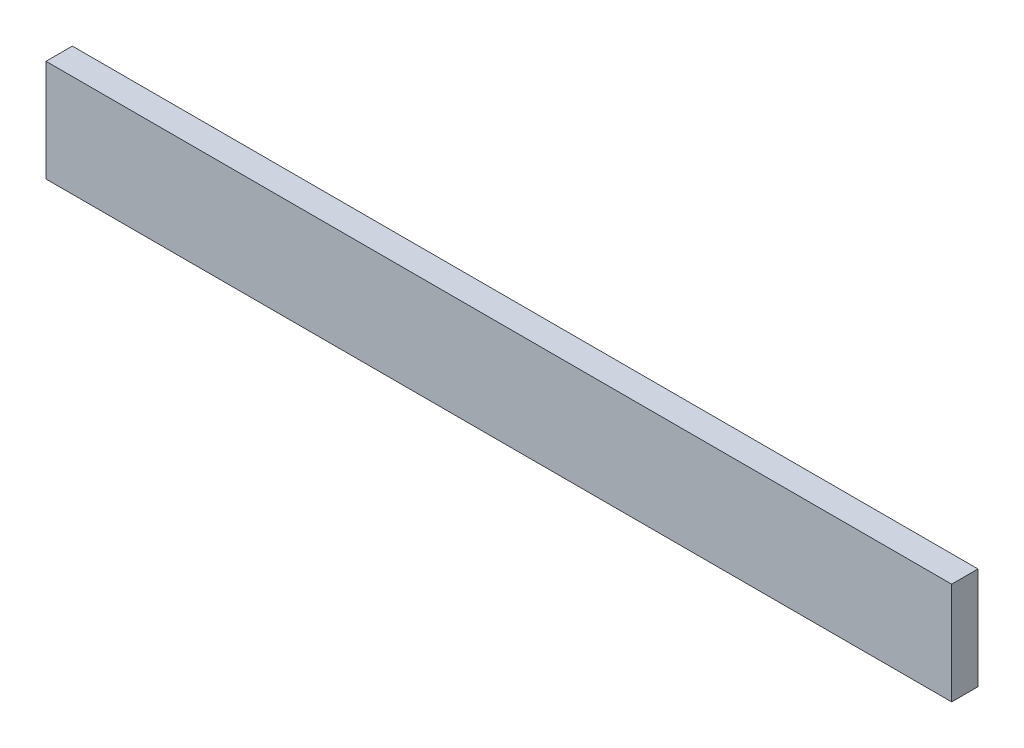
ISO-10303-21;
HEADER;
FILE_DESCRIPTION(('STEP AP214'),'2;1');
FILE_NAME('part.step','',(''),(''),'','','');
FILE_SCHEMA(('AUTOMOTIVE_DESIGN { 1 0 10303 214 1 1 1 1 }'));
ENDSEC;
DATA;
#1=APPLICATION_CONTEXT('core data for automotive mechanical design processes');
#2=APPLICATION_PROTOCOL_DEFINITION('international standard','automotive_design',2000,#1);
#3=PRODUCT_CONTEXT('',#1,'mechanical');
#4=PRODUCT('Part','Part','',(#3));
#5=PRODUCT_RELATED_PRODUCT_CATEGORY('part','',(#4));
#6=PRODUCT_DEFINITION_FORMATION('','',#4);
#7=PRODUCT_DEFINITION_CONTEXT('part definition',#1,'design');
#8=PRODUCT_DEFINITION('design','',#6,#7);
#9=PRODUCT_DEFINITION_SHAPE('','',#8);
#10=(LENGTH_UNIT() NAMED_UNIT(*) SI_UNIT(.MILLI.,.METRE.));
#11=(NAMED_UNIT(*) PLANE_ANGLE_UNIT() SI_UNIT($,.RADIAN.));
#12=(NAMED_UNIT(*) SI_UNIT($,.STERADIAN.) SOLID_ANGLE_UNIT());
#13=UNCERTAINTY_MEASURE_WITH_UNIT(LENGTH_MEASURE(1.E-05),#10,'distance_accuracy_value','');
#14=(GEOMETRIC_REPRESENTATION_CONTEXT(3) GLOBAL_UNCERTAINTY_ASSIGNED_CONTEXT((#13)) GLOBAL_UNIT_ASSIGNED_CONTEXT((#10,
#11,#12)) REPRESENTATION_CONTEXT('',''));
#15=CARTESIAN_POINT('',(0.,0.,0.));
#16=DIRECTION('',(0.,0.,1.));
#17=DIRECTION('',(1.,0.,0.));
#18=AXIS2_PLACEMENT_3D('',#15,#16,#17);
#19=CARTESIAN_POINT('',(-275.,30.97,16.));
#20=DIRECTION('',(1.,0.,0.));
#21=DIRECTION('',(0.,0.,-1.));
#22=AXIS2_PLACEMENT_3D('',#19,#20,#21);
#23=PLANE('',#22);
#24=DIRECTION('',(0.,-1.,0.));
#25=VECTOR('',#24,1.);
#26=CARTESIAN_POINT('',(-275.,30.97,0.));
#27=LINE('',#26,#25);
#28=CARTESIAN_POINT('',(-275.,30.97,0.));
#29=VERTEX_POINT('',#28);
#30=CARTESIAN_POINT('',(-275.,-30.97,0.));
#31=VERTEX_POINT('',#30);
#32=EDGE_CURVE('E96',#29,#31,#27,.T.);
#33=ORIENTED_EDGE('',*,*,#32,.T.);
#34=DIRECTION('',(0.,0.,-1.));
#35=VECTOR('',#34,1.);
#36=CARTESIAN_POINT('',(-275.,-30.97,16.));
#37=LINE('',#36,#35);
#38=CARTESIAN_POINT('',(-275.,-30.97,16.));
#39=VERTEX_POINT('',#38);
#40=EDGE_CURVE('E11',#39,#31,#37,.T.);
#41=ORIENTED_EDGE('',*,*,#40,.F.);
#42=DIRECTION('',(0.,-1.,0.));
#43=VECTOR('',#42,1.);
#44=CARTESIAN_POINT('',(-275.,30.97,16.));
#45=LINE('',#44,#43);
#46=CARTESIAN_POINT('',(-275.,30.97,16.));
#47=VERTEX_POINT('',#46);
#48=EDGE_CURVE('E84',#47,#39,#45,.T.);
#49=ORIENTED_EDGE('',*,*,#48,.F.);
#50=DIRECTION('',(0.,0.,-1.));
#51=VECTOR('',#50,1.);
#52=CARTESIAN_POINT('',(-275.,30.97,16.));
#53=LINE('',#52,#51);
#54=EDGE_CURVE('E92',#47,#29,#53,.T.);
#55=ORIENTED_EDGE('',*,*,#54,.T.);
#56=EDGE_LOOP('',(#33,#41,#49,#55));
#57=FACE_BOUND('',#56,.T.);
#58=ADVANCED_FACE('F33',(#57),#23,.F.);
#59=CARTESIAN_POINT('',(-275.,-30.97,16.));
#60=DIRECTION('',(0.,1.,0.));
#61=DIRECTION('',(0.,0.,1.));
#62=AXIS2_PLACEMENT_3D('',#59,#60,#61);
#63=PLANE('',#62);
#64=DIRECTION('',(1.,0.,0.));
#65=VECTOR('',#64,1.);
#66=CARTESIAN_POINT('',(-275.,-30.97,0.));
#67=LINE('',#66,#65);
#68=CARTESIAN_POINT('',(275.,-30.97,0.));
#69=VERTEX_POINT('',#68);
#70=EDGE_CURVE('E88',#31,#69,#67,.T.);
#71=ORIENTED_EDGE('',*,*,#70,.T.);
#72=DIRECTION('',(0.,0.,-1.));
#73=VECTOR('',#72,1.);
#74=CARTESIAN_POINT('',(275.,-30.97,16.));
#75=LINE('',#74,#73);
#76=CARTESIAN_POINT('',(275.,-30.97,16.));
#77=VERTEX_POINT('',#76);
#78=EDGE_CURVE('E41',#77,#69,#75,.T.);
#79=ORIENTED_EDGE('',*,*,#78,.F.);
#80=DIRECTION('',(1.,0.,0.));
#81=VECTOR('',#80,1.);
#82=CARTESIAN_POINT('',(-275.,-30.97,16.));
#83=LINE('',#82,#81);
#84=EDGE_CURVE('E79',#39,#77,#83,.T.);
#85=ORIENTED_EDGE('',*,*,#84,.F.);
#86=ORIENTED_EDGE('',*,*,#40,.T.);
#87=EDGE_LOOP('',(#71,#79,#85,#86));
#88=FACE_BOUND('',#87,.T.);
#89=ADVANCED_FACE('F87',(#88),#63,.F.);
#90=CARTESIAN_POINT('',(275.,30.97,16.));
#91=DIRECTION('',(-1.,0.,0.));
#92=DIRECTION('',(0.,0.,1.));
#93=AXIS2_PLACEMENT_3D('',#90,#91,#92);
#94=PLANE('',#93);
#95=DIRECTION('',(0.,1.,0.));
#96=VECTOR('',#95,1.);
#97=CARTESIAN_POINT('',(275.,30.97,0.));
#98=LINE('',#97,#96);
#99=CARTESIAN_POINT('',(275.,30.97,0.));
#100=VERTEX_POINT('',#99);
#101=EDGE_CURVE('E66',#69,#100,#98,.T.);
#102=ORIENTED_EDGE('',*,*,#101,.T.);
#103=DIRECTION('',(0.,0.,-1.));
#104=VECTOR('',#103,1.);
#105=CARTESIAN_POINT('',(275.,30.97,16.));
#106=LINE('',#105,#104);
#107=CARTESIAN_POINT('',(275.,30.97,16.));
#108=VERTEX_POINT('',#107);
#109=EDGE_CURVE('E89',#108,#100,#106,.T.);
#110=ORIENTED_EDGE('',*,*,#109,.F.);
#111=DIRECTION('',(0.,1.,0.));
#112=VECTOR('',#111,1.);
#113=CARTESIAN_POINT('',(275.,30.97,16.));
#114=LINE('',#113,#112);
#115=EDGE_CURVE('E82',#77,#108,#114,.T.);
#116=ORIENTED_EDGE('',*,*,#115,.F.);
#117=ORIENTED_EDGE('',*,*,#78,.T.);
#118=EDGE_LOOP('',(#102,#110,#116,#117));
#119=FACE_BOUND('',#118,.T.);
#120=ADVANCED_FACE('F90',(#119),#94,.F.);
#121=CARTESIAN_POINT('',(-275.,30.97,16.));
#122=DIRECTION('',(0.,-1.,0.));
#123=DIRECTION('',(0.,0.,-1.));
#124=AXIS2_PLACEMENT_3D('',#121,#122,#123);
#125=PLANE('',#124);
#126=DIRECTION('',(-1.,0.,0.));
#127=VECTOR('',#126,1.);
#128=CARTESIAN_POINT('',(-275.,30.97,0.));
#129=LINE('',#128,#127);
#130=EDGE_CURVE('E72',#100,#29,#129,.T.);
#131=ORIENTED_EDGE('',*,*,#130,.T.);
#132=ORIENTED_EDGE('',*,*,#54,.F.);
#133=DIRECTION('',(-1.,0.,0.));
#134=VECTOR('',#133,1.);
#135=CARTESIAN_POINT('',(-275.,30.97,16.));
#136=LINE('',#135,#134);
#137=EDGE_CURVE('E49',#108,#47,#136,.T.);
#138=ORIENTED_EDGE('',*,*,#137,.F.);
#139=ORIENTED_EDGE('',*,*,#109,.T.);
#140=EDGE_LOOP('',(#131,#132,#138,#139));
#141=FACE_BOUND('',#140,.T.);
#142=ADVANCED_FACE('F103',(#141),#125,.F.);
#143=CARTESIAN_POINT('',(0.,0.,16.));
#144=DIRECTION('',(0.,0.,1.));
#145=DIRECTION('',(1.,0.,0.));
#146=AXIS2_PLACEMENT_3D('',#143,#144,#145);
#147=PLANE('',#146);
#148=ORIENTED_EDGE('',*,*,#48,.T.);
#149=ORIENTED_EDGE('',*,*,#84,.T.);
#150=ORIENTED_EDGE('',*,*,#115,.T.);
#151=ORIENTED_EDGE('',*,*,#137,.T.);
#152=EDGE_LOOP('',(#148,#149,#150,#151));
#153=FACE_BOUND('',#152,.T.);
#154=ADVANCED_FACE('F80',(#153),#147,.T.);
#155=CARTESIAN_POINT('',(0.,0.,0.));
#156=DIRECTION('',(0.,0.,1.));
#157=DIRECTION('',(1.,0.,0.));
#158=AXIS2_PLACEMENT_3D('',#155,#156,#157);
#159=PLANE('',#158);
#160=ORIENTED_EDGE('',*,*,#32,.F.);
#161=ORIENTED_EDGE('',*,*,#130,.F.);
#162=ORIENTED_EDGE('',*,*,#101,.F.);
#163=ORIENTED_EDGE('',*,*,#70,.F.);
#164=EDGE_LOOP('',(#160,#161,#162,#163));
#165=FACE_BOUND('',#164,.T.);
#166=ADVANCED_FACE('F106',(#165),#159,.F.);
#167=CLOSED_SHELL('',(#58,#89,#120,#142,#154,#166));
#168=MANIFOLD_SOLID_BREP('B2',#167);
#169=ADVANCED_BREP_SHAPE_REPRESENTATION('',(#18,#168),#14);
#170=SHAPE_DEFINITION_REPRESENTATION(#9,#169);
ENDSEC;
END-ISO-10303-21;
